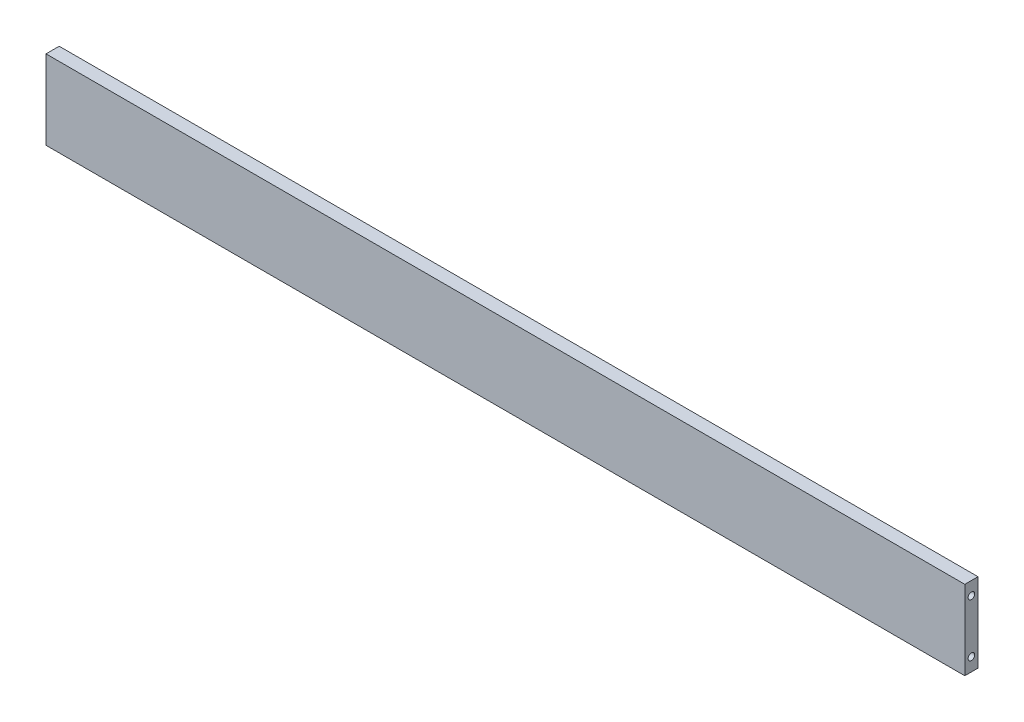
ISO-10303-21;
HEADER;
FILE_DESCRIPTION(('STEP AP214'),'2;1');
FILE_NAME('part.step','',(''),(''),'','','');
FILE_SCHEMA(('AUTOMOTIVE_DESIGN { 1 0 10303 214 1 1 1 1 }'));
ENDSEC;
DATA;
#1=APPLICATION_CONTEXT('core data for automotive mechanical design processes');
#2=APPLICATION_PROTOCOL_DEFINITION('international standard','automotive_design',2000,#1);
#3=PRODUCT_CONTEXT('',#1,'mechanical');
#4=PRODUCT('Part','Part','',(#3));
#5=PRODUCT_RELATED_PRODUCT_CATEGORY('part','',(#4));
#6=PRODUCT_DEFINITION_FORMATION('','',#4);
#7=PRODUCT_DEFINITION_CONTEXT('part definition',#1,'design');
#8=PRODUCT_DEFINITION('design','',#6,#7);
#9=PRODUCT_DEFINITION_SHAPE('','',#8);
#10=(LENGTH_UNIT() NAMED_UNIT(*) SI_UNIT(.MILLI.,.METRE.));
#11=(NAMED_UNIT(*) PLANE_ANGLE_UNIT() SI_UNIT($,.RADIAN.));
#12=(NAMED_UNIT(*) SI_UNIT($,.STERADIAN.) SOLID_ANGLE_UNIT());
#13=UNCERTAINTY_MEASURE_WITH_UNIT(LENGTH_MEASURE(1.E-05),#10,'distance_accuracy_value','');
#14=(GEOMETRIC_REPRESENTATION_CONTEXT(3) GLOBAL_UNCERTAINTY_ASSIGNED_CONTEXT((#13)) GLOBAL_UNIT_ASSIGNED_CONTEXT((#10,
#11,#12)) REPRESENTATION_CONTEXT('',''));
#15=CARTESIAN_POINT('',(0.,0.,0.));
#16=DIRECTION('',(0.,0.,1.));
#17=DIRECTION('',(1.,0.,0.));
#18=AXIS2_PLACEMENT_3D('',#15,#16,#17);
#19=CARTESIAN_POINT('',(348.,-30.,5.));
#20=DIRECTION('',(-1.,0.,0.));
#21=DIRECTION('',(0.,0.,1.));
#22=AXIS2_PLACEMENT_3D('',#19,#20,#21);
#23=PLANE('',#22);
#24=CARTESIAN_POINT('',(348.,-20.,0.));
#25=DIRECTION('',(1.,0.,0.));
#26=DIRECTION('',(0.,0.,-1.));
#27=AXIS2_PLACEMENT_3D('',#24,#25,#26);
#28=CIRCLE('',#27,2.5);
#29=CARTESIAN_POINT('',(348.,-20.,-2.5));
#30=VERTEX_POINT('',#29);
#31=EDGE_CURVE('E164',#30,#30,#28,.T.);
#32=ORIENTED_EDGE('',*,*,#31,.F.);
#33=EDGE_LOOP('',(#32));
#34=FACE_BOUND('',#33,.T.);
#35=CARTESIAN_POINT('',(348.,20.,0.));
#36=DIRECTION('',(1.,0.,0.));
#37=DIRECTION('',(0.,0.,-1.));
#38=AXIS2_PLACEMENT_3D('',#35,#36,#37);
#39=CIRCLE('',#38,2.5);
#40=CARTESIAN_POINT('',(348.,20.,-2.5));
#41=VERTEX_POINT('',#40);
#42=EDGE_CURVE('E170',#41,#41,#39,.T.);
#43=ORIENTED_EDGE('',*,*,#42,.F.);
#44=EDGE_LOOP('',(#43));
#45=FACE_BOUND('',#44,.T.);
#46=DIRECTION('',(0.,1.,0.));
#47=VECTOR('',#46,1.);
#48=CARTESIAN_POINT('',(348.,-30.,-5.));
#49=LINE('',#48,#47);
#50=CARTESIAN_POINT('',(348.,-30.,-5.));
#51=VERTEX_POINT('',#50);
#52=CARTESIAN_POINT('',(348.,30.,-5.));
#53=VERTEX_POINT('',#52);
#54=EDGE_CURVE('E176',#51,#53,#49,.T.);
#55=ORIENTED_EDGE('',*,*,#54,.T.);
#56=DIRECTION('',(0.,0.,-1.));
#57=VECTOR('',#56,1.);
#58=CARTESIAN_POINT('',(348.,30.,5.));
#59=LINE('',#58,#57);
#60=CARTESIAN_POINT('',(348.,30.,5.));
#61=VERTEX_POINT('',#60);
#62=EDGE_CURVE('E11',#61,#53,#59,.T.);
#63=ORIENTED_EDGE('',*,*,#62,.F.);
#64=DIRECTION('',(0.,1.,0.));
#65=VECTOR('',#64,1.);
#66=CARTESIAN_POINT('',(348.,-30.,5.));
#67=LINE('',#66,#65);
#68=CARTESIAN_POINT('',(348.,-30.,5.));
#69=VERTEX_POINT('',#68);
#70=EDGE_CURVE('E177',#69,#61,#67,.T.);
#71=ORIENTED_EDGE('',*,*,#70,.F.);
#72=DIRECTION('',(0.,0.,-1.));
#73=VECTOR('',#72,1.);
#74=CARTESIAN_POINT('',(348.,-30.,5.));
#75=LINE('',#74,#73);
#76=EDGE_CURVE('E183',#69,#51,#75,.T.);
#77=ORIENTED_EDGE('',*,*,#76,.T.);
#78=EDGE_LOOP('',(#55,#63,#71,#77));
#79=FACE_BOUND('',#78,.T.);
#80=ADVANCED_FACE('F38',(#34,#45,#79),#23,.F.);
#81=CARTESIAN_POINT('',(-348.,30.,5.));
#82=DIRECTION('',(0.,-1.,0.));
#83=DIRECTION('',(0.,0.,-1.));
#84=AXIS2_PLACEMENT_3D('',#81,#82,#83);
#85=PLANE('',#84);
#86=DIRECTION('',(-1.,0.,0.));
#87=VECTOR('',#86,1.);
#88=CARTESIAN_POINT('',(-348.,30.,-5.));
#89=LINE('',#88,#87);
#90=CARTESIAN_POINT('',(-348.,30.,-5.));
#91=VERTEX_POINT('',#90);
#92=EDGE_CURVE('E186',#53,#91,#89,.T.);
#93=ORIENTED_EDGE('',*,*,#92,.T.);
#94=DIRECTION('',(0.,0.,-1.));
#95=VECTOR('',#94,1.);
#96=CARTESIAN_POINT('',(-348.,30.,5.));
#97=LINE('',#96,#95);
#98=CARTESIAN_POINT('',(-348.,30.,5.));
#99=VERTEX_POINT('',#98);
#100=EDGE_CURVE('E46',#99,#91,#97,.T.);
#101=ORIENTED_EDGE('',*,*,#100,.F.);
#102=DIRECTION('',(-1.,0.,0.));
#103=VECTOR('',#102,1.);
#104=CARTESIAN_POINT('',(-348.,30.,5.));
#105=LINE('',#104,#103);
#106=EDGE_CURVE('E85',#61,#99,#105,.T.);
#107=ORIENTED_EDGE('',*,*,#106,.F.);
#108=ORIENTED_EDGE('',*,*,#62,.T.);
#109=EDGE_LOOP('',(#93,#101,#107,#108));
#110=FACE_BOUND('',#109,.T.);
#111=ADVANCED_FACE('F210',(#110),#85,.F.);
#112=CARTESIAN_POINT('',(-348.,-30.,5.));
#113=DIRECTION('',(1.,0.,0.));
#114=DIRECTION('',(0.,0.,-1.));
#115=AXIS2_PLACEMENT_3D('',#112,#113,#114);
#116=PLANE('',#115);
#117=CARTESIAN_POINT('',(-348.,-20.,0.));
#118=DIRECTION('',(-1.,0.,0.));
#119=DIRECTION('',(0.,0.,1.));
#120=AXIS2_PLACEMENT_3D('',#117,#118,#119);
#121=CIRCLE('',#120,2.5);
#122=CARTESIAN_POINT('',(-348.,-20.,2.49999999999999));
#123=VERTEX_POINT('',#122);
#124=EDGE_CURVE('E152',#123,#123,#121,.T.);
#125=ORIENTED_EDGE('',*,*,#124,.F.);
#126=EDGE_LOOP('',(#125));
#127=FACE_BOUND('',#126,.T.);
#128=CARTESIAN_POINT('',(-348.,20.,0.));
#129=DIRECTION('',(-1.,0.,0.));
#130=DIRECTION('',(0.,0.,1.));
#131=AXIS2_PLACEMENT_3D('',#128,#129,#130);
#132=CIRCLE('',#131,2.5);
#133=CARTESIAN_POINT('',(-348.,20.,2.49999999999999));
#134=VERTEX_POINT('',#133);
#135=EDGE_CURVE('E158',#134,#134,#132,.T.);
#136=ORIENTED_EDGE('',*,*,#135,.F.);
#137=EDGE_LOOP('',(#136));
#138=FACE_BOUND('',#137,.T.);
#139=DIRECTION('',(0.,-1.,0.));
#140=VECTOR('',#139,1.);
#141=CARTESIAN_POINT('',(-348.,-30.,-5.));
#142=LINE('',#141,#140);
#143=CARTESIAN_POINT('',(-348.,-30.,-5.));
#144=VERTEX_POINT('',#143);
#145=EDGE_CURVE('E72',#91,#144,#142,.T.);
#146=ORIENTED_EDGE('',*,*,#145,.T.);
#147=DIRECTION('',(0.,0.,-1.));
#148=VECTOR('',#147,1.);
#149=CARTESIAN_POINT('',(-348.,-30.,5.));
#150=LINE('',#149,#148);
#151=CARTESIAN_POINT('',(-348.,-30.,5.));
#152=VERTEX_POINT('',#151);
#153=EDGE_CURVE('E191',#152,#144,#150,.T.);
#154=ORIENTED_EDGE('',*,*,#153,.F.);
#155=DIRECTION('',(0.,-1.,0.));
#156=VECTOR('',#155,1.);
#157=CARTESIAN_POINT('',(-348.,-30.,5.));
#158=LINE('',#157,#156);
#159=EDGE_CURVE('E180',#99,#152,#158,.T.);
#160=ORIENTED_EDGE('',*,*,#159,.F.);
#161=ORIENTED_EDGE('',*,*,#100,.T.);
#162=EDGE_LOOP('',(#146,#154,#160,#161));
#163=FACE_BOUND('',#162,.T.);
#164=ADVANCED_FACE('F193',(#127,#138,#163),#116,.F.);
#165=CARTESIAN_POINT('',(-348.,-30.,5.));
#166=DIRECTION('',(0.,1.,0.));
#167=DIRECTION('',(0.,0.,1.));
#168=AXIS2_PLACEMENT_3D('',#165,#166,#167);
#169=PLANE('',#168);
#170=CARTESIAN_POINT('',(-300.,-30.,0.));
#171=DIRECTION('',(0.,-1.,0.));
#172=DIRECTION('',(0.,0.,-1.));
#173=AXIS2_PLACEMENT_3D('',#170,#171,#172);
#174=CIRCLE('',#173,2.5);
#175=CARTESIAN_POINT('',(-300.,-30.,-2.50000000000002));
#176=VERTEX_POINT('',#175);
#177=EDGE_CURVE('E124',#176,#176,#174,.T.);
#178=ORIENTED_EDGE('',*,*,#177,.F.);
#179=EDGE_LOOP('',(#178));
#180=FACE_BOUND('',#179,.T.);
#181=CARTESIAN_POINT('',(-150.,-30.,0.));
#182=DIRECTION('',(0.,-1.,0.));
#183=DIRECTION('',(0.,0.,-1.));
#184=AXIS2_PLACEMENT_3D('',#181,#182,#183);
#185=CIRCLE('',#184,2.5);
#186=CARTESIAN_POINT('',(-150.,-30.,-2.50000000000001));
#187=VERTEX_POINT('',#186);
#188=EDGE_CURVE('E123',#187,#187,#185,.T.);
#189=ORIENTED_EDGE('',*,*,#188,.F.);
#190=EDGE_LOOP('',(#189));
#191=FACE_BOUND('',#190,.T.);
#192=CARTESIAN_POINT('',(150.,-30.,0.));
#193=DIRECTION('',(0.,-1.,0.));
#194=DIRECTION('',(0.,0.,-1.));
#195=AXIS2_PLACEMENT_3D('',#192,#193,#194);
#196=CIRCLE('',#195,2.5);
#197=CARTESIAN_POINT('',(150.,-30.,-2.49999999999997));
#198=VERTEX_POINT('',#197);
#199=EDGE_CURVE('E134',#198,#198,#196,.T.);
#200=ORIENTED_EDGE('',*,*,#199,.F.);
#201=EDGE_LOOP('',(#200));
#202=FACE_BOUND('',#201,.T.);
#203=CARTESIAN_POINT('',(300.,-30.,0.));
#204=DIRECTION('',(0.,-1.,0.));
#205=DIRECTION('',(0.,0.,-1.));
#206=AXIS2_PLACEMENT_3D('',#203,#204,#205);
#207=CIRCLE('',#206,2.5);
#208=CARTESIAN_POINT('',(300.,-30.,-2.5));
#209=VERTEX_POINT('',#208);
#210=EDGE_CURVE('E140',#209,#209,#207,.T.);
#211=ORIENTED_EDGE('',*,*,#210,.F.);
#212=EDGE_LOOP('',(#211));
#213=FACE_BOUND('',#212,.T.);
#214=CARTESIAN_POINT('',(0.,-30.,0.));
#215=DIRECTION('',(0.,-1.,0.));
#216=DIRECTION('',(0.,0.,-1.));
#217=AXIS2_PLACEMENT_3D('',#214,#215,#216);
#218=CIRCLE('',#217,2.49999999999999);
#219=CARTESIAN_POINT('',(0.,-30.,-2.49999999999998));
#220=VERTEX_POINT('',#219);
#221=EDGE_CURVE('E146',#220,#220,#218,.T.);
#222=ORIENTED_EDGE('',*,*,#221,.F.);
#223=EDGE_LOOP('',(#222));
#224=FACE_BOUND('',#223,.T.);
#225=DIRECTION('',(1.,0.,0.));
#226=VECTOR('',#225,1.);
#227=CARTESIAN_POINT('',(-348.,-30.,-5.));
#228=LINE('',#227,#226);
#229=EDGE_CURVE('E78',#144,#51,#228,.T.);
#230=ORIENTED_EDGE('',*,*,#229,.T.);
#231=ORIENTED_EDGE('',*,*,#76,.F.);
#232=DIRECTION('',(1.,0.,0.));
#233=VECTOR('',#232,1.);
#234=CARTESIAN_POINT('',(-348.,-30.,5.));
#235=LINE('',#234,#233);
#236=EDGE_CURVE('E54',#152,#69,#235,.T.);
#237=ORIENTED_EDGE('',*,*,#236,.F.);
#238=ORIENTED_EDGE('',*,*,#153,.T.);
#239=EDGE_LOOP('',(#230,#231,#237,#238));
#240=FACE_BOUND('',#239,.T.);
#241=ADVANCED_FACE('F200',(#180,#191,#202,#213,#224,#240),#169,.F.);
#242=CARTESIAN_POINT('',(0.,0.,5.));
#243=DIRECTION('',(0.,0.,-1.));
#244=DIRECTION('',(-1.,0.,0.));
#245=AXIS2_PLACEMENT_3D('',#242,#243,#244);
#246=PLANE('',#245);
#247=ORIENTED_EDGE('',*,*,#70,.T.);
#248=ORIENTED_EDGE('',*,*,#106,.T.);
#249=ORIENTED_EDGE('',*,*,#159,.T.);
#250=ORIENTED_EDGE('',*,*,#236,.T.);
#251=EDGE_LOOP('',(#247,#248,#249,#250));
#252=FACE_BOUND('',#251,.T.);
#253=ADVANCED_FACE('F202',(#252),#246,.F.);
#254=CARTESIAN_POINT('',(0.,0.,-5.));
#255=DIRECTION('',(0.,0.,-1.));
#256=DIRECTION('',(-1.,0.,0.));
#257=AXIS2_PLACEMENT_3D('',#254,#255,#256);
#258=PLANE('',#257);
#259=ORIENTED_EDGE('',*,*,#54,.F.);
#260=ORIENTED_EDGE('',*,*,#229,.F.);
#261=ORIENTED_EDGE('',*,*,#145,.F.);
#262=ORIENTED_EDGE('',*,*,#92,.F.);
#263=EDGE_LOOP('',(#259,#260,#261,#262));
#264=FACE_BOUND('',#263,.T.);
#265=ADVANCED_FACE('F196',(#264),#258,.T.);
#266=CARTESIAN_POINT('',(333.,20.,0.));
#267=DIRECTION('',(1.,0.,0.));
#268=DIRECTION('',(0.,0.,-1.));
#269=AXIS2_PLACEMENT_3D('',#266,#267,#268);
#270=CONICAL_SURFACE('',#269,2.5,1.02974425867666);
#271=CARTESIAN_POINT('',(331.497848452431,20.,0.));
#272=VERTEX_POINT('',#271);
#273=VERTEX_LOOP('',#272);
#274=FACE_BOUND('',#273,.T.);
#275=CARTESIAN_POINT('',(333.,20.,0.));
#276=DIRECTION('',(1.,0.,0.));
#277=DIRECTION('',(0.,0.,-1.));
#278=AXIS2_PLACEMENT_3D('',#275,#276,#277);
#279=CIRCLE('',#278,2.5);
#280=CARTESIAN_POINT('',(333.,20.,-2.5));
#281=VERTEX_POINT('',#280);
#282=EDGE_CURVE('E173',#281,#281,#279,.T.);
#283=ORIENTED_EDGE('',*,*,#282,.T.);
#284=EDGE_LOOP('',(#283));
#285=FACE_BOUND('',#284,.T.);
#286=ADVANCED_FACE('F228',(#274,#285),#270,.F.);
#287=CARTESIAN_POINT('',(348.,20.,0.));
#288=DIRECTION('',(1.,0.,0.));
#289=DIRECTION('',(0.,0.,-1.));
#290=AXIS2_PLACEMENT_3D('',#287,#288,#289);
#291=CYLINDRICAL_SURFACE('',#290,2.5);
#292=ORIENTED_EDGE('',*,*,#282,.F.);
#293=EDGE_LOOP('',(#292));
#294=FACE_BOUND('',#293,.T.);
#295=ORIENTED_EDGE('',*,*,#42,.T.);
#296=EDGE_LOOP('',(#295));
#297=FACE_BOUND('',#296,.T.);
#298=ADVANCED_FACE('F225',(#294,#297),#291,.F.);
#299=CARTESIAN_POINT('',(333.,-20.,0.));
#300=DIRECTION('',(1.,0.,0.));
#301=DIRECTION('',(0.,0.,-1.));
#302=AXIS2_PLACEMENT_3D('',#299,#300,#301);
#303=CONICAL_SURFACE('',#302,2.5,1.02974425867666);
#304=CARTESIAN_POINT('',(331.497848452431,-20.,0.));
#305=VERTEX_POINT('',#304);
#306=VERTEX_LOOP('',#305);
#307=FACE_BOUND('',#306,.T.);
#308=CARTESIAN_POINT('',(333.,-20.,0.));
#309=DIRECTION('',(1.,0.,0.));
#310=DIRECTION('',(0.,0.,-1.));
#311=AXIS2_PLACEMENT_3D('',#308,#309,#310);
#312=CIRCLE('',#311,2.5);
#313=CARTESIAN_POINT('',(333.,-20.,-2.5));
#314=VERTEX_POINT('',#313);
#315=EDGE_CURVE('E167',#314,#314,#312,.T.);
#316=ORIENTED_EDGE('',*,*,#315,.T.);
#317=EDGE_LOOP('',(#316));
#318=FACE_BOUND('',#317,.T.);
#319=ADVANCED_FACE('F227',(#307,#318),#303,.F.);
#320=CARTESIAN_POINT('',(348.,-20.,0.));
#321=DIRECTION('',(1.,0.,0.));
#322=DIRECTION('',(0.,0.,-1.));
#323=AXIS2_PLACEMENT_3D('',#320,#321,#322);
#324=CYLINDRICAL_SURFACE('',#323,2.5);
#325=ORIENTED_EDGE('',*,*,#315,.F.);
#326=EDGE_LOOP('',(#325));
#327=FACE_BOUND('',#326,.T.);
#328=ORIENTED_EDGE('',*,*,#31,.T.);
#329=EDGE_LOOP('',(#328));
#330=FACE_BOUND('',#329,.T.);
#331=ADVANCED_FACE('F235',(#327,#330),#324,.F.);
#332=CARTESIAN_POINT('',(-333.,20.,0.));
#333=DIRECTION('',(-1.,0.,0.));
#334=DIRECTION('',(0.,0.,1.));
#335=AXIS2_PLACEMENT_3D('',#332,#333,#334);
#336=CONICAL_SURFACE('',#335,2.5,1.02974425867666);
#337=CARTESIAN_POINT('',(-331.497848452431,20.,0.));
#338=VERTEX_POINT('',#337);
#339=VERTEX_LOOP('',#338);
#340=FACE_BOUND('',#339,.T.);
#341=CARTESIAN_POINT('',(-333.,20.,0.));
#342=DIRECTION('',(-1.,0.,0.));
#343=DIRECTION('',(0.,0.,1.));
#344=AXIS2_PLACEMENT_3D('',#341,#342,#343);
#345=CIRCLE('',#344,2.5);
#346=CARTESIAN_POINT('',(-333.,20.,2.49999999999999));
#347=VERTEX_POINT('',#346);
#348=EDGE_CURVE('E161',#347,#347,#345,.T.);
#349=ORIENTED_EDGE('',*,*,#348,.T.);
#350=EDGE_LOOP('',(#349));
#351=FACE_BOUND('',#350,.T.);
#352=ADVANCED_FACE('F280',(#340,#351),#336,.F.);
#353=CARTESIAN_POINT('',(-348.,20.,0.));
#354=DIRECTION('',(-1.,0.,0.));
#355=DIRECTION('',(0.,0.,1.));
#356=AXIS2_PLACEMENT_3D('',#353,#354,#355);
#357=CYLINDRICAL_SURFACE('',#356,2.5);
#358=ORIENTED_EDGE('',*,*,#348,.F.);
#359=EDGE_LOOP('',(#358));
#360=FACE_BOUND('',#359,.T.);
#361=ORIENTED_EDGE('',*,*,#135,.T.);
#362=EDGE_LOOP('',(#361));
#363=FACE_BOUND('',#362,.T.);
#364=ADVANCED_FACE('F298',(#360,#363),#357,.F.);
#365=CARTESIAN_POINT('',(-333.,-20.,0.));
#366=DIRECTION('',(-1.,0.,0.));
#367=DIRECTION('',(0.,0.,1.));
#368=AXIS2_PLACEMENT_3D('',#365,#366,#367);
#369=CONICAL_SURFACE('',#368,2.5,1.02974425867666);
#370=CARTESIAN_POINT('',(-331.497848452431,-20.,0.));
#371=VERTEX_POINT('',#370);
#372=VERTEX_LOOP('',#371);
#373=FACE_BOUND('',#372,.T.);
#374=CARTESIAN_POINT('',(-333.,-20.,0.));
#375=DIRECTION('',(-1.,0.,0.));
#376=DIRECTION('',(0.,0.,1.));
#377=AXIS2_PLACEMENT_3D('',#374,#375,#376);
#378=CIRCLE('',#377,2.5);
#379=CARTESIAN_POINT('',(-333.,-20.,2.49999999999999));
#380=VERTEX_POINT('',#379);
#381=EDGE_CURVE('E155',#380,#380,#378,.T.);
#382=ORIENTED_EDGE('',*,*,#381,.T.);
#383=EDGE_LOOP('',(#382));
#384=FACE_BOUND('',#383,.T.);
#385=ADVANCED_FACE('F308',(#373,#384),#369,.F.);
#386=CARTESIAN_POINT('',(-348.,-20.,0.));
#387=DIRECTION('',(-1.,0.,0.));
#388=DIRECTION('',(0.,0.,1.));
#389=AXIS2_PLACEMENT_3D('',#386,#387,#388);
#390=CYLINDRICAL_SURFACE('',#389,2.5);
#391=ORIENTED_EDGE('',*,*,#381,.F.);
#392=EDGE_LOOP('',(#391));
#393=FACE_BOUND('',#392,.T.);
#394=ORIENTED_EDGE('',*,*,#124,.T.);
#395=EDGE_LOOP('',(#394));
#396=FACE_BOUND('',#395,.T.);
#397=ADVANCED_FACE('F320',(#393,#396),#390,.F.);
#398=CARTESIAN_POINT('',(0.,-15.,0.));
#399=DIRECTION('',(0.,-1.,0.));
#400=DIRECTION('',(0.,0.,-1.));
#401=AXIS2_PLACEMENT_3D('',#398,#399,#400);
#402=CONICAL_SURFACE('',#401,2.49999999999999,1.02974425867665);
#403=CARTESIAN_POINT('',(0.,-13.4978484524311,0.));
#404=VERTEX_POINT('',#403);
#405=VERTEX_LOOP('',#404);
#406=FACE_BOUND('',#405,.T.);
#407=CARTESIAN_POINT('',(0.,-15.,0.));
#408=DIRECTION('',(0.,-1.,0.));
#409=DIRECTION('',(0.,0.,-1.));
#410=AXIS2_PLACEMENT_3D('',#407,#408,#409);
#411=CIRCLE('',#410,2.49999999999999);
#412=CARTESIAN_POINT('',(0.,-15.,-2.49999999999998));
#413=VERTEX_POINT('',#412);
#414=EDGE_CURVE('E149',#413,#413,#411,.T.);
#415=ORIENTED_EDGE('',*,*,#414,.T.);
#416=EDGE_LOOP('',(#415));
#417=FACE_BOUND('',#416,.T.);
#418=ADVANCED_FACE('F329',(#406,#417),#402,.F.);
#419=CARTESIAN_POINT('',(0.,-30.,0.));
#420=DIRECTION('',(0.,-1.,0.));
#421=DIRECTION('',(0.,0.,-1.));
#422=AXIS2_PLACEMENT_3D('',#419,#420,#421);
#423=CYLINDRICAL_SURFACE('',#422,2.49999999999999);
#424=ORIENTED_EDGE('',*,*,#414,.F.);
#425=EDGE_LOOP('',(#424));
#426=FACE_BOUND('',#425,.T.);
#427=ORIENTED_EDGE('',*,*,#221,.T.);
#428=EDGE_LOOP('',(#427));
#429=FACE_BOUND('',#428,.T.);
#430=ADVANCED_FACE('F346',(#426,#429),#423,.F.);
#431=CARTESIAN_POINT('',(300.,-15.,0.));
#432=DIRECTION('',(0.,-1.,0.));
#433=DIRECTION('',(0.,0.,-1.));
#434=AXIS2_PLACEMENT_3D('',#431,#432,#433);
#435=CONICAL_SURFACE('',#434,2.5,1.02974425867666);
#436=CARTESIAN_POINT('',(300.,-13.4978484524311,0.));
#437=VERTEX_POINT('',#436);
#438=VERTEX_LOOP('',#437);
#439=FACE_BOUND('',#438,.T.);
#440=CARTESIAN_POINT('',(300.,-15.,0.));
#441=DIRECTION('',(0.,-1.,0.));
#442=DIRECTION('',(0.,0.,-1.));
#443=AXIS2_PLACEMENT_3D('',#440,#441,#442);
#444=CIRCLE('',#443,2.5);
#445=CARTESIAN_POINT('',(300.,-15.,-2.5));
#446=VERTEX_POINT('',#445);
#447=EDGE_CURVE('E143',#446,#446,#444,.T.);
#448=ORIENTED_EDGE('',*,*,#447,.T.);
#449=EDGE_LOOP('',(#448));
#450=FACE_BOUND('',#449,.T.);
#451=ADVANCED_FACE('F356',(#439,#450),#435,.F.);
#452=CARTESIAN_POINT('',(300.,-30.,0.));
#453=DIRECTION('',(0.,-1.,0.));
#454=DIRECTION('',(0.,0.,-1.));
#455=AXIS2_PLACEMENT_3D('',#452,#453,#454);
#456=CYLINDRICAL_SURFACE('',#455,2.5);
#457=ORIENTED_EDGE('',*,*,#447,.F.);
#458=EDGE_LOOP('',(#457));
#459=FACE_BOUND('',#458,.T.);
#460=ORIENTED_EDGE('',*,*,#210,.T.);
#461=EDGE_LOOP('',(#460));
#462=FACE_BOUND('',#461,.T.);
#463=ADVANCED_FACE('F368',(#459,#462),#456,.F.);
#464=CARTESIAN_POINT('',(150.,-15.,0.));
#465=DIRECTION('',(0.,-1.,0.));
#466=DIRECTION('',(0.,0.,-1.));
#467=AXIS2_PLACEMENT_3D('',#464,#465,#466);
#468=CONICAL_SURFACE('',#467,2.49999999999997,1.02974425867665);
#469=CARTESIAN_POINT('',(150.,-13.4978484524311,0.));
#470=VERTEX_POINT('',#469);
#471=VERTEX_LOOP('',#470);
#472=FACE_BOUND('',#471,.T.);
#473=CARTESIAN_POINT('',(150.,-15.,0.));
#474=DIRECTION('',(0.,-1.,0.));
#475=DIRECTION('',(0.,0.,-1.));
#476=AXIS2_PLACEMENT_3D('',#473,#474,#475);
#477=CIRCLE('',#476,2.49999999999997);
#478=CARTESIAN_POINT('',(150.,-15.,-2.49999999999994));
#479=VERTEX_POINT('',#478);
#480=EDGE_CURVE('E137',#479,#479,#477,.T.);
#481=ORIENTED_EDGE('',*,*,#480,.T.);
#482=EDGE_LOOP('',(#481));
#483=FACE_BOUND('',#482,.T.);
#484=ADVANCED_FACE('F378',(#472,#483),#468,.F.);
#485=CARTESIAN_POINT('',(150.,-30.,0.));
#486=DIRECTION('',(0.,-1.,0.));
#487=DIRECTION('',(0.,0.,-1.));
#488=AXIS2_PLACEMENT_3D('',#485,#486,#487);
#489=CYLINDRICAL_SURFACE('',#488,2.49999999999999);
#490=ORIENTED_EDGE('',*,*,#480,.F.);
#491=EDGE_LOOP('',(#490));
#492=FACE_BOUND('',#491,.T.);
#493=ORIENTED_EDGE('',*,*,#199,.T.);
#494=EDGE_LOOP('',(#493));
#495=FACE_BOUND('',#494,.T.);
#496=ADVANCED_FACE('F390',(#492,#495),#489,.F.);
#497=CARTESIAN_POINT('',(-150.,-15.,0.));
#498=DIRECTION('',(0.,-1.,0.));
#499=DIRECTION('',(0.,0.,-1.));
#500=AXIS2_PLACEMENT_3D('',#497,#498,#499);
#501=CONICAL_SURFACE('',#500,2.49999999999997,1.02974425867665);
#502=CARTESIAN_POINT('',(-150.,-13.4978484524311,0.));
#503=VERTEX_POINT('',#502);
#504=VERTEX_LOOP('',#503);
#505=FACE_BOUND('',#504,.T.);
#506=CARTESIAN_POINT('',(-150.,-15.,0.));
#507=DIRECTION('',(0.,-1.,0.));
#508=DIRECTION('',(0.,0.,-1.));
#509=AXIS2_PLACEMENT_3D('',#506,#507,#508);
#510=CIRCLE('',#509,2.49999999999997);
#511=CARTESIAN_POINT('',(-150.,-15.,-2.49999999999998));
#512=VERTEX_POINT('',#511);
#513=EDGE_CURVE('E127',#512,#512,#510,.T.);
#514=ORIENTED_EDGE('',*,*,#513,.T.);
#515=EDGE_LOOP('',(#514));
#516=FACE_BOUND('',#515,.T.);
#517=ADVANCED_FACE('F400',(#505,#516),#501,.F.);
#518=CARTESIAN_POINT('',(-150.,-30.,0.));
#519=DIRECTION('',(0.,-1.,0.));
#520=DIRECTION('',(0.,0.,-1.));
#521=AXIS2_PLACEMENT_3D('',#518,#519,#520);
#522=CYLINDRICAL_SURFACE('',#521,2.49999999999999);
#523=ORIENTED_EDGE('',*,*,#513,.F.);
#524=EDGE_LOOP('',(#523));
#525=FACE_BOUND('',#524,.T.);
#526=ORIENTED_EDGE('',*,*,#188,.T.);
#527=EDGE_LOOP('',(#526));
#528=FACE_BOUND('',#527,.T.);
#529=ADVANCED_FACE('F117',(#525,#528),#522,.F.);
#530=CARTESIAN_POINT('',(-300.,-15.,0.));
#531=DIRECTION('',(0.,-1.,0.));
#532=DIRECTION('',(0.,0.,-1.));
#533=AXIS2_PLACEMENT_3D('',#530,#531,#532);
#534=CONICAL_SURFACE('',#533,2.5,1.02974425867666);
#535=CARTESIAN_POINT('',(-300.,-13.4978484524311,0.));
#536=VERTEX_POINT('',#535);
#537=VERTEX_LOOP('',#536);
#538=FACE_BOUND('',#537,.T.);
#539=CARTESIAN_POINT('',(-300.,-15.,0.));
#540=DIRECTION('',(0.,-1.,0.));
#541=DIRECTION('',(0.,0.,-1.));
#542=AXIS2_PLACEMENT_3D('',#539,#540,#541);
#543=CIRCLE('',#542,2.5);
#544=CARTESIAN_POINT('',(-300.,-15.,-2.50000000000002));
#545=VERTEX_POINT('',#544);
#546=EDGE_CURVE('E121',#545,#545,#543,.T.);
#547=ORIENTED_EDGE('',*,*,#546,.T.);
#548=EDGE_LOOP('',(#547));
#549=FACE_BOUND('',#548,.T.);
#550=ADVANCED_FACE('F113',(#538,#549),#534,.F.);
#551=CARTESIAN_POINT('',(-300.,-30.,0.));
#552=DIRECTION('',(0.,-1.,0.));
#553=DIRECTION('',(0.,0.,-1.));
#554=AXIS2_PLACEMENT_3D('',#551,#552,#553);
#555=CYLINDRICAL_SURFACE('',#554,2.5);
#556=ORIENTED_EDGE('',*,*,#546,.F.);
#557=EDGE_LOOP('',(#556));
#558=FACE_BOUND('',#557,.T.);
#559=ORIENTED_EDGE('',*,*,#177,.T.);
#560=EDGE_LOOP('',(#559));
#561=FACE_BOUND('',#560,.T.);
#562=ADVANCED_FACE('F116',(#558,#561),#555,.F.);
#563=CLOSED_SHELL('',(#80,#111,#164,#241,#253,#265,#286,#298,#319,#331,#352,#364,#385,#397,#418,
#430,#451,#463,#484,#496,#517,#529,#550,#562));
#564=MANIFOLD_SOLID_BREP('B2',#563);
#565=ADVANCED_BREP_SHAPE_REPRESENTATION('',(#18,#564),#14);
#566=SHAPE_DEFINITION_REPRESENTATION(#9,#565);
ENDSEC;
END-ISO-10303-21;
